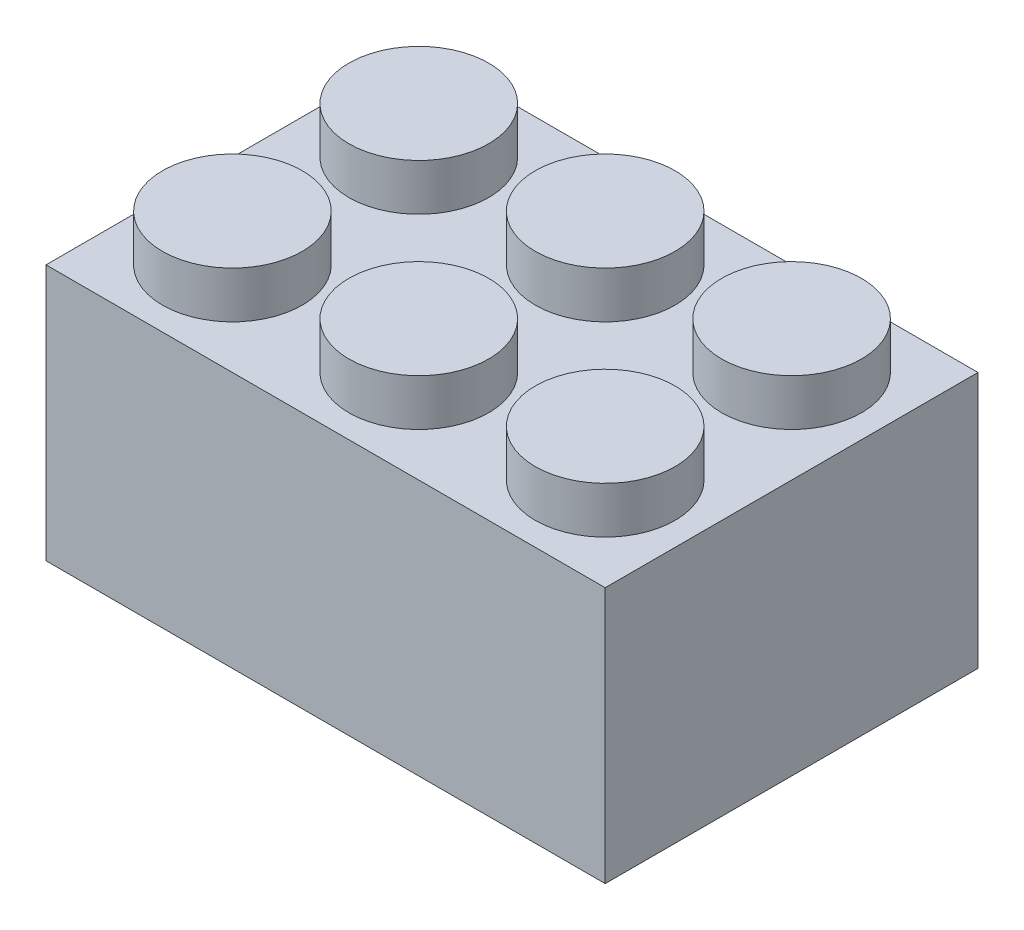
ISO-10303-21;
HEADER;
FILE_DESCRIPTION(('STEP AP214'),'2;1');
FILE_NAME('part.step','',(''),(''),'','','');
FILE_SCHEMA(('AUTOMOTIVE_DESIGN { 1 0 10303 214 1 1 1 1 }'));
ENDSEC;
DATA;
#1=APPLICATION_CONTEXT('core data for automotive mechanical design processes');
#2=APPLICATION_PROTOCOL_DEFINITION('international standard','automotive_design',2000,#1);
#3=PRODUCT_CONTEXT('',#1,'mechanical');
#4=PRODUCT('Part','Part','',(#3));
#5=PRODUCT_RELATED_PRODUCT_CATEGORY('part','',(#4));
#6=PRODUCT_DEFINITION_FORMATION('','',#4);
#7=PRODUCT_DEFINITION_CONTEXT('part definition',#1,'design');
#8=PRODUCT_DEFINITION('design','',#6,#7);
#9=PRODUCT_DEFINITION_SHAPE('','',#8);
#10=(LENGTH_UNIT() NAMED_UNIT(*) SI_UNIT(.MILLI.,.METRE.));
#11=(NAMED_UNIT(*) PLANE_ANGLE_UNIT() SI_UNIT($,.RADIAN.));
#12=(NAMED_UNIT(*) SI_UNIT($,.STERADIAN.) SOLID_ANGLE_UNIT());
#13=UNCERTAINTY_MEASURE_WITH_UNIT(LENGTH_MEASURE(1.E-05),#10,'distance_accuracy_value','');
#14=(GEOMETRIC_REPRESENTATION_CONTEXT(3) GLOBAL_UNCERTAINTY_ASSIGNED_CONTEXT((#13)) GLOBAL_UNIT_ASSIGNED_CONTEXT((#10,
#11,#12)) REPRESENTATION_CONTEXT('',''));
#15=CARTESIAN_POINT('',(0.,0.,0.));
#16=DIRECTION('',(0.,0.,1.));
#17=DIRECTION('',(1.,0.,0.));
#18=AXIS2_PLACEMENT_3D('',#15,#16,#17);
#19=CARTESIAN_POINT('',(8.,13.,4.));
#20=DIRECTION('',(0.,1.,0.));
#21=DIRECTION('',(0.,0.,1.));
#22=AXIS2_PLACEMENT_3D('',#19,#20,#21);
#23=PLANE('',#22);
#24=CARTESIAN_POINT('',(8.,13.,4.));
#25=DIRECTION('',(0.,1.,0.));
#26=DIRECTION('',(0.,0.,1.));
#27=AXIS2_PLACEMENT_3D('',#24,#25,#26);
#28=CIRCLE('',#27,3.);
#29=CARTESIAN_POINT('',(8.,13.,7.));
#30=VERTEX_POINT('',#29);
#31=EDGE_CURVE('E11',#30,#30,#28,.T.);
#32=ORIENTED_EDGE('',*,*,#31,.T.);
#33=EDGE_LOOP('',(#32));
#34=FACE_BOUND('',#33,.T.);
#35=ADVANCED_FACE('F33',(#34),#23,.T.);
#36=CARTESIAN_POINT('',(8.,13.,4.));
#37=DIRECTION('',(0.,-1.,0.));
#38=DIRECTION('',(0.,0.,-1.));
#39=AXIS2_PLACEMENT_3D('',#36,#37,#38);
#40=CYLINDRICAL_SURFACE('',#39,3.);
#41=ORIENTED_EDGE('',*,*,#31,.F.);
#42=EDGE_LOOP('',(#41));
#43=FACE_BOUND('',#42,.T.);
#44=CARTESIAN_POINT('',(8.,11.,4.));
#45=DIRECTION('',(0.,1.,0.));
#46=DIRECTION('',(0.,0.,1.));
#47=AXIS2_PLACEMENT_3D('',#44,#45,#46);
#48=CIRCLE('',#47,3.);
#49=CARTESIAN_POINT('',(8.,11.,7.));
#50=VERTEX_POINT('',#49);
#51=EDGE_CURVE('E40',#50,#50,#48,.T.);
#52=ORIENTED_EDGE('',*,*,#51,.T.);
#53=EDGE_LOOP('',(#52));
#54=FACE_BOUND('',#53,.T.);
#55=ADVANCED_FACE('F228',(#43,#54),#40,.T.);
#56=CARTESIAN_POINT('',(0.,13.,4.));
#57=DIRECTION('',(0.,1.,0.));
#58=DIRECTION('',(0.,0.,1.));
#59=AXIS2_PLACEMENT_3D('',#56,#57,#58);
#60=PLANE('',#59);
#61=CARTESIAN_POINT('',(0.,13.,4.));
#62=DIRECTION('',(0.,1.,0.));
#63=DIRECTION('',(0.,0.,1.));
#64=AXIS2_PLACEMENT_3D('',#61,#62,#63);
#65=CIRCLE('',#64,3.);
#66=CARTESIAN_POINT('',(0.,13.,7.));
#67=VERTEX_POINT('',#66);
#68=EDGE_CURVE('E223',#67,#67,#65,.T.);
#69=ORIENTED_EDGE('',*,*,#68,.T.);
#70=EDGE_LOOP('',(#69));
#71=FACE_BOUND('',#70,.T.);
#72=ADVANCED_FACE('F253',(#71),#60,.T.);
#73=CARTESIAN_POINT('',(0.,13.,4.));
#74=DIRECTION('',(0.,-1.,0.));
#75=DIRECTION('',(0.,0.,-1.));
#76=AXIS2_PLACEMENT_3D('',#73,#74,#75);
#77=CYLINDRICAL_SURFACE('',#76,3.);
#78=ORIENTED_EDGE('',*,*,#68,.F.);
#79=EDGE_LOOP('',(#78));
#80=FACE_BOUND('',#79,.T.);
#81=CARTESIAN_POINT('',(0.,11.,4.));
#82=DIRECTION('',(0.,1.,0.));
#83=DIRECTION('',(0.,0.,1.));
#84=AXIS2_PLACEMENT_3D('',#81,#82,#83);
#85=CIRCLE('',#84,3.);
#86=CARTESIAN_POINT('',(0.,11.,7.));
#87=VERTEX_POINT('',#86);
#88=EDGE_CURVE('E220',#87,#87,#85,.T.);
#89=ORIENTED_EDGE('',*,*,#88,.T.);
#90=EDGE_LOOP('',(#89));
#91=FACE_BOUND('',#90,.T.);
#92=ADVANCED_FACE('F259',(#80,#91),#77,.T.);
#93=CARTESIAN_POINT('',(-8.,13.,4.));
#94=DIRECTION('',(0.,1.,0.));
#95=DIRECTION('',(0.,0.,1.));
#96=AXIS2_PLACEMENT_3D('',#93,#94,#95);
#97=PLANE('',#96);
#98=CARTESIAN_POINT('',(-8.,13.,4.));
#99=DIRECTION('',(0.,1.,0.));
#100=DIRECTION('',(0.,0.,1.));
#101=AXIS2_PLACEMENT_3D('',#98,#99,#100);
#102=CIRCLE('',#101,3.);
#103=CARTESIAN_POINT('',(-8.,13.,7.));
#104=VERTEX_POINT('',#103);
#105=EDGE_CURVE('E217',#104,#104,#102,.T.);
#106=ORIENTED_EDGE('',*,*,#105,.T.);
#107=EDGE_LOOP('',(#106));
#108=FACE_BOUND('',#107,.T.);
#109=ADVANCED_FACE('F265',(#108),#97,.T.);
#110=CARTESIAN_POINT('',(-8.,13.,4.));
#111=DIRECTION('',(0.,-1.,0.));
#112=DIRECTION('',(0.,0.,-1.));
#113=AXIS2_PLACEMENT_3D('',#110,#111,#112);
#114=CYLINDRICAL_SURFACE('',#113,3.);
#115=ORIENTED_EDGE('',*,*,#105,.F.);
#116=EDGE_LOOP('',(#115));
#117=FACE_BOUND('',#116,.T.);
#118=CARTESIAN_POINT('',(-8.,11.,4.));
#119=DIRECTION('',(0.,1.,0.));
#120=DIRECTION('',(0.,0.,1.));
#121=AXIS2_PLACEMENT_3D('',#118,#119,#120);
#122=CIRCLE('',#121,3.);
#123=CARTESIAN_POINT('',(-8.,11.,7.));
#124=VERTEX_POINT('',#123);
#125=EDGE_CURVE('E214',#124,#124,#122,.T.);
#126=ORIENTED_EDGE('',*,*,#125,.T.);
#127=EDGE_LOOP('',(#126));
#128=FACE_BOUND('',#127,.T.);
#129=ADVANCED_FACE('F269',(#117,#128),#114,.T.);
#130=CARTESIAN_POINT('',(8.,13.,-4.));
#131=DIRECTION('',(0.,1.,0.));
#132=DIRECTION('',(0.,0.,1.));
#133=AXIS2_PLACEMENT_3D('',#130,#131,#132);
#134=PLANE('',#133);
#135=CARTESIAN_POINT('',(8.,13.,-4.));
#136=DIRECTION('',(0.,1.,0.));
#137=DIRECTION('',(0.,0.,1.));
#138=AXIS2_PLACEMENT_3D('',#135,#136,#137);
#139=CIRCLE('',#138,3.);
#140=CARTESIAN_POINT('',(8.,13.,-1.));
#141=VERTEX_POINT('',#140);
#142=EDGE_CURVE('E211',#141,#141,#139,.T.);
#143=ORIENTED_EDGE('',*,*,#142,.T.);
#144=EDGE_LOOP('',(#143));
#145=FACE_BOUND('',#144,.T.);
#146=ADVANCED_FACE('F273',(#145),#134,.T.);
#147=CARTESIAN_POINT('',(8.,13.,-4.));
#148=DIRECTION('',(0.,-1.,0.));
#149=DIRECTION('',(0.,0.,-1.));
#150=AXIS2_PLACEMENT_3D('',#147,#148,#149);
#151=CYLINDRICAL_SURFACE('',#150,3.);
#152=ORIENTED_EDGE('',*,*,#142,.F.);
#153=EDGE_LOOP('',(#152));
#154=FACE_BOUND('',#153,.T.);
#155=CARTESIAN_POINT('',(8.,11.,-4.));
#156=DIRECTION('',(0.,1.,0.));
#157=DIRECTION('',(0.,0.,1.));
#158=AXIS2_PLACEMENT_3D('',#155,#156,#157);
#159=CIRCLE('',#158,3.);
#160=CARTESIAN_POINT('',(8.,11.,-1.));
#161=VERTEX_POINT('',#160);
#162=EDGE_CURVE('E208',#161,#161,#159,.T.);
#163=ORIENTED_EDGE('',*,*,#162,.T.);
#164=EDGE_LOOP('',(#163));
#165=FACE_BOUND('',#164,.T.);
#166=ADVANCED_FACE('F277',(#154,#165),#151,.T.);
#167=CARTESIAN_POINT('',(-12.,11.,8.));
#168=DIRECTION('',(1.,0.,0.));
#169=DIRECTION('',(0.,0.,-1.));
#170=AXIS2_PLACEMENT_3D('',#167,#168,#169);
#171=PLANE('',#170);
#172=DIRECTION('',(0.,0.,1.));
#173=VECTOR('',#172,1.);
#174=CARTESIAN_POINT('',(-12.,0.,8.));
#175=LINE('',#174,#173);
#176=CARTESIAN_POINT('',(-12.,0.,-8.));
#177=VERTEX_POINT('',#176);
#178=CARTESIAN_POINT('',(-12.,0.,8.));
#179=VERTEX_POINT('',#178);
#180=EDGE_CURVE('E183',#177,#179,#175,.T.);
#181=ORIENTED_EDGE('',*,*,#180,.T.);
#182=DIRECTION('',(0.,-1.,0.));
#183=VECTOR('',#182,1.);
#184=CARTESIAN_POINT('',(-12.,11.,8.));
#185=LINE('',#184,#183);
#186=CARTESIAN_POINT('',(-12.,11.,8.));
#187=VERTEX_POINT('',#186);
#188=EDGE_CURVE('E206',#187,#179,#185,.T.);
#189=ORIENTED_EDGE('',*,*,#188,.F.);
#190=DIRECTION('',(0.,0.,1.));
#191=VECTOR('',#190,1.);
#192=CARTESIAN_POINT('',(-12.,11.,8.));
#193=LINE('',#192,#191);
#194=CARTESIAN_POINT('',(-12.,11.,-8.));
#195=VERTEX_POINT('',#194);
#196=EDGE_CURVE('E186',#195,#187,#193,.T.);
#197=ORIENTED_EDGE('',*,*,#196,.F.);
#198=DIRECTION('',(0.,-1.,0.));
#199=VECTOR('',#198,1.);
#200=CARTESIAN_POINT('',(-12.,11.,-8.));
#201=LINE('',#200,#199);
#202=EDGE_CURVE('E192',#195,#177,#201,.T.);
#203=ORIENTED_EDGE('',*,*,#202,.T.);
#204=EDGE_LOOP('',(#181,#189,#197,#203));
#205=FACE_BOUND('',#204,.T.);
#206=ADVANCED_FACE('F281',(#205),#171,.F.);
#207=CARTESIAN_POINT('',(12.,11.,8.));
#208=DIRECTION('',(0.,0.,-1.));
#209=DIRECTION('',(-1.,0.,0.));
#210=AXIS2_PLACEMENT_3D('',#207,#208,#209);
#211=PLANE('',#210);
#212=DIRECTION('',(1.,0.,0.));
#213=VECTOR('',#212,1.);
#214=CARTESIAN_POINT('',(12.,0.,8.));
#215=LINE('',#214,#213);
#216=CARTESIAN_POINT('',(12.,0.,8.));
#217=VERTEX_POINT('',#216);
#218=EDGE_CURVE('E195',#179,#217,#215,.T.);
#219=ORIENTED_EDGE('',*,*,#218,.T.);
#220=DIRECTION('',(0.,-1.,0.));
#221=VECTOR('',#220,1.);
#222=CARTESIAN_POINT('',(12.,11.,8.));
#223=LINE('',#222,#221);
#224=CARTESIAN_POINT('',(12.,11.,8.));
#225=VERTEX_POINT('',#224);
#226=EDGE_CURVE('E203',#225,#217,#223,.T.);
#227=ORIENTED_EDGE('',*,*,#226,.F.);
#228=DIRECTION('',(1.,0.,0.));
#229=VECTOR('',#228,1.);
#230=CARTESIAN_POINT('',(12.,11.,8.));
#231=LINE('',#230,#229);
#232=EDGE_CURVE('E85',#187,#225,#231,.T.);
#233=ORIENTED_EDGE('',*,*,#232,.F.);
#234=ORIENTED_EDGE('',*,*,#188,.T.);
#235=EDGE_LOOP('',(#219,#227,#233,#234));
#236=FACE_BOUND('',#235,.T.);
#237=ADVANCED_FACE('F285',(#236),#211,.F.);
#238=CARTESIAN_POINT('',(12.,11.,8.));
#239=DIRECTION('',(-1.,0.,0.));
#240=DIRECTION('',(0.,0.,1.));
#241=AXIS2_PLACEMENT_3D('',#238,#239,#240);
#242=PLANE('',#241);
#243=DIRECTION('',(0.,0.,-1.));
#244=VECTOR('',#243,1.);
#245=CARTESIAN_POINT('',(12.,0.,8.));
#246=LINE('',#245,#244);
#247=CARTESIAN_POINT('',(12.,0.,-8.));
#248=VERTEX_POINT('',#247);
#249=EDGE_CURVE('E197',#217,#248,#246,.T.);
#250=ORIENTED_EDGE('',*,*,#249,.T.);
#251=DIRECTION('',(0.,-1.,0.));
#252=VECTOR('',#251,1.);
#253=CARTESIAN_POINT('',(12.,11.,-8.));
#254=LINE('',#253,#252);
#255=CARTESIAN_POINT('',(12.,11.,-8.));
#256=VERTEX_POINT('',#255);
#257=EDGE_CURVE('E201',#256,#248,#254,.T.);
#258=ORIENTED_EDGE('',*,*,#257,.F.);
#259=DIRECTION('',(0.,0.,-1.));
#260=VECTOR('',#259,1.);
#261=CARTESIAN_POINT('',(12.,11.,8.));
#262=LINE('',#261,#260);
#263=EDGE_CURVE('E189',#225,#256,#262,.T.);
#264=ORIENTED_EDGE('',*,*,#263,.F.);
#265=ORIENTED_EDGE('',*,*,#226,.T.);
#266=EDGE_LOOP('',(#250,#258,#264,#265));
#267=FACE_BOUND('',#266,.T.);
#268=ADVANCED_FACE('F243',(#267),#242,.F.);
#269=CARTESIAN_POINT('',(12.,11.,-8.));
#270=DIRECTION('',(0.,0.,1.));
#271=DIRECTION('',(1.,0.,0.));
#272=AXIS2_PLACEMENT_3D('',#269,#270,#271);
#273=PLANE('',#272);
#274=DIRECTION('',(-1.,0.,0.));
#275=VECTOR('',#274,1.);
#276=CARTESIAN_POINT('',(12.,0.,-8.));
#277=LINE('',#276,#275);
#278=EDGE_CURVE('E77',#248,#177,#277,.T.);
#279=ORIENTED_EDGE('',*,*,#278,.T.);
#280=ORIENTED_EDGE('',*,*,#202,.F.);
#281=DIRECTION('',(-1.,0.,0.));
#282=VECTOR('',#281,1.);
#283=CARTESIAN_POINT('',(12.,11.,-8.));
#284=LINE('',#283,#282);
#285=EDGE_CURVE('E56',#256,#195,#284,.T.);
#286=ORIENTED_EDGE('',*,*,#285,.F.);
#287=ORIENTED_EDGE('',*,*,#257,.T.);
#288=EDGE_LOOP('',(#279,#280,#286,#287));
#289=FACE_BOUND('',#288,.T.);
#290=ADVANCED_FACE('F233',(#289),#273,.F.);
#291=CARTESIAN_POINT('',(0.,11.,0.));
#292=DIRECTION('',(0.,1.,0.));
#293=DIRECTION('',(0.,0.,1.));
#294=AXIS2_PLACEMENT_3D('',#291,#292,#293);
#295=PLANE('',#294);
#296=CARTESIAN_POINT('',(0.,11.,-4.));
#297=DIRECTION('',(0.,1.,0.));
#298=DIRECTION('',(0.,0.,1.));
#299=AXIS2_PLACEMENT_3D('',#296,#297,#298);
#300=CIRCLE('',#299,3.);
#301=CARTESIAN_POINT('',(0.,11.,-1.));
#302=VERTEX_POINT('',#301);
#303=EDGE_CURVE('E172',#302,#302,#300,.T.);
#304=ORIENTED_EDGE('',*,*,#303,.F.);
#305=EDGE_LOOP('',(#304));
#306=FACE_BOUND('',#305,.T.);
#307=CARTESIAN_POINT('',(-8.,11.,-4.));
#308=DIRECTION('',(0.,1.,0.));
#309=DIRECTION('',(0.,0.,1.));
#310=AXIS2_PLACEMENT_3D('',#307,#308,#309);
#311=CIRCLE('',#310,3.);
#312=CARTESIAN_POINT('',(-8.,11.,-1.));
#313=VERTEX_POINT('',#312);
#314=EDGE_CURVE('E179',#313,#313,#311,.T.);
#315=ORIENTED_EDGE('',*,*,#314,.F.);
#316=EDGE_LOOP('',(#315));
#317=FACE_BOUND('',#316,.T.);
#318=ORIENTED_EDGE('',*,*,#196,.T.);
#319=ORIENTED_EDGE('',*,*,#232,.T.);
#320=ORIENTED_EDGE('',*,*,#263,.T.);
#321=ORIENTED_EDGE('',*,*,#285,.T.);
#322=EDGE_LOOP('',(#318,#319,#320,#321));
#323=FACE_BOUND('',#322,.T.);
#324=ORIENTED_EDGE('',*,*,#162,.F.);
#325=EDGE_LOOP('',(#324));
#326=FACE_BOUND('',#325,.T.);
#327=ORIENTED_EDGE('',*,*,#125,.F.);
#328=EDGE_LOOP('',(#327));
#329=FACE_BOUND('',#328,.T.);
#330=ORIENTED_EDGE('',*,*,#88,.F.);
#331=EDGE_LOOP('',(#330));
#332=FACE_BOUND('',#331,.T.);
#333=ORIENTED_EDGE('',*,*,#51,.F.);
#334=EDGE_LOOP('',(#333));
#335=FACE_BOUND('',#334,.T.);
#336=ADVANCED_FACE('F230',(#306,#317,#323,#326,#329,#332,#335),#295,.T.);
#337=CARTESIAN_POINT('',(0.,0.,0.));
#338=DIRECTION('',(0.,1.,0.));
#339=DIRECTION('',(0.,0.,1.));
#340=AXIS2_PLACEMENT_3D('',#337,#338,#339);
#341=PLANE('',#340);
#342=DIRECTION('',(-1.,0.,0.));
#343=VECTOR('',#342,1.);
#344=CARTESIAN_POINT('',(12.,0.,-7.));
#345=LINE('',#344,#343);
#346=CARTESIAN_POINT('',(11.,0.,-7.));
#347=VERTEX_POINT('',#346);
#348=CARTESIAN_POINT('',(-11.,0.,-7.));
#349=VERTEX_POINT('',#348);
#350=EDGE_CURVE('E167',#347,#349,#345,.T.);
#351=ORIENTED_EDGE('',*,*,#350,.T.);
#352=DIRECTION('',(0.,0.,1.));
#353=VECTOR('',#352,1.);
#354=CARTESIAN_POINT('',(-11.,0.,8.));
#355=LINE('',#354,#353);
#356=CARTESIAN_POINT('',(-11.,0.,7.));
#357=VERTEX_POINT('',#356);
#358=EDGE_CURVE('E158',#349,#357,#355,.T.);
#359=ORIENTED_EDGE('',*,*,#358,.T.);
#360=DIRECTION('',(1.,0.,0.));
#361=VECTOR('',#360,1.);
#362=CARTESIAN_POINT('',(12.,0.,7.));
#363=LINE('',#362,#361);
#364=CARTESIAN_POINT('',(11.,0.,7.));
#365=VERTEX_POINT('',#364);
#366=EDGE_CURVE('E166',#357,#365,#363,.T.);
#367=ORIENTED_EDGE('',*,*,#366,.T.);
#368=DIRECTION('',(0.,0.,-1.));
#369=VECTOR('',#368,1.);
#370=CARTESIAN_POINT('',(11.,0.,8.));
#371=LINE('',#370,#369);
#372=EDGE_CURVE('E47',#365,#347,#371,.T.);
#373=ORIENTED_EDGE('',*,*,#372,.T.);
#374=EDGE_LOOP('',(#351,#359,#367,#373));
#375=FACE_BOUND('',#374,.T.);
#376=ORIENTED_EDGE('',*,*,#180,.F.);
#377=ORIENTED_EDGE('',*,*,#278,.F.);
#378=ORIENTED_EDGE('',*,*,#249,.F.);
#379=ORIENTED_EDGE('',*,*,#218,.F.);
#380=EDGE_LOOP('',(#376,#377,#378,#379));
#381=FACE_BOUND('',#380,.T.);
#382=ADVANCED_FACE('F232',(#375,#381),#341,.F.);
#383=CARTESIAN_POINT('',(-8.,13.,-4.));
#384=DIRECTION('',(0.,-1.,0.));
#385=DIRECTION('',(0.,0.,-1.));
#386=AXIS2_PLACEMENT_3D('',#383,#384,#385);
#387=CYLINDRICAL_SURFACE('',#386,3.);
#388=CARTESIAN_POINT('',(-8.,13.,-4.));
#389=DIRECTION('',(0.,1.,0.));
#390=DIRECTION('',(0.,0.,1.));
#391=AXIS2_PLACEMENT_3D('',#388,#389,#390);
#392=CIRCLE('',#391,3.);
#393=CARTESIAN_POINT('',(-8.,13.,-1.));
#394=VERTEX_POINT('',#393);
#395=EDGE_CURVE('E180',#394,#394,#392,.T.);
#396=ORIENTED_EDGE('',*,*,#395,.F.);
#397=EDGE_LOOP('',(#396));
#398=FACE_BOUND('',#397,.T.);
#399=ORIENTED_EDGE('',*,*,#314,.T.);
#400=EDGE_LOOP('',(#399));
#401=FACE_BOUND('',#400,.T.);
#402=ADVANCED_FACE('F240',(#398,#401),#387,.T.);
#403=CARTESIAN_POINT('',(-8.,13.,-4.));
#404=DIRECTION('',(0.,1.,0.));
#405=DIRECTION('',(0.,0.,1.));
#406=AXIS2_PLACEMENT_3D('',#403,#404,#405);
#407=PLANE('',#406);
#408=ORIENTED_EDGE('',*,*,#395,.T.);
#409=EDGE_LOOP('',(#408));
#410=FACE_BOUND('',#409,.T.);
#411=ADVANCED_FACE('F325',(#410),#407,.T.);
#412=CARTESIAN_POINT('',(0.,13.,-4.));
#413=DIRECTION('',(0.,-1.,0.));
#414=DIRECTION('',(0.,0.,-1.));
#415=AXIS2_PLACEMENT_3D('',#412,#413,#414);
#416=CYLINDRICAL_SURFACE('',#415,3.);
#417=CARTESIAN_POINT('',(0.,13.,-4.));
#418=DIRECTION('',(0.,1.,0.));
#419=DIRECTION('',(0.,0.,1.));
#420=AXIS2_PLACEMENT_3D('',#417,#418,#419);
#421=CIRCLE('',#420,3.);
#422=CARTESIAN_POINT('',(0.,13.,-1.));
#423=VERTEX_POINT('',#422);
#424=EDGE_CURVE('E175',#423,#423,#421,.T.);
#425=ORIENTED_EDGE('',*,*,#424,.F.);
#426=EDGE_LOOP('',(#425));
#427=FACE_BOUND('',#426,.T.);
#428=ORIENTED_EDGE('',*,*,#303,.T.);
#429=EDGE_LOOP('',(#428));
#430=FACE_BOUND('',#429,.T.);
#431=ADVANCED_FACE('F334',(#427,#430),#416,.T.);
#432=CARTESIAN_POINT('',(0.,13.,-4.));
#433=DIRECTION('',(0.,1.,0.));
#434=DIRECTION('',(0.,0.,1.));
#435=AXIS2_PLACEMENT_3D('',#432,#433,#434);
#436=PLANE('',#435);
#437=ORIENTED_EDGE('',*,*,#424,.T.);
#438=EDGE_LOOP('',(#437));
#439=FACE_BOUND('',#438,.T.);
#440=ADVANCED_FACE('F392',(#439),#436,.T.);
#441=CARTESIAN_POINT('',(8.,12.,4.));
#442=DIRECTION('',(0.,1.,0.));
#443=DIRECTION('',(0.,0.,1.));
#444=AXIS2_PLACEMENT_3D('',#441,#442,#443);
#445=PLANE('',#444);
#446=CARTESIAN_POINT('',(8.,12.,4.));
#447=DIRECTION('',(0.,1.,0.));
#448=DIRECTION('',(0.,0.,1.));
#449=AXIS2_PLACEMENT_3D('',#446,#447,#448);
#450=CIRCLE('',#449,2.);
#451=CARTESIAN_POINT('',(8.,12.,6.));
#452=VERTEX_POINT('',#451);
#453=EDGE_CURVE('E176',#452,#452,#450,.T.);
#454=ORIENTED_EDGE('',*,*,#453,.F.);
#455=EDGE_LOOP('',(#454));
#456=FACE_BOUND('',#455,.T.);
#457=ADVANCED_FACE('F402',(#456),#445,.F.);
#458=CARTESIAN_POINT('',(8.,13.,4.));
#459=DIRECTION('',(0.,-1.,0.));
#460=DIRECTION('',(0.,0.,-1.));
#461=AXIS2_PLACEMENT_3D('',#458,#459,#460);
#462=CYLINDRICAL_SURFACE('',#461,2.);
#463=ORIENTED_EDGE('',*,*,#453,.T.);
#464=EDGE_LOOP('',(#463));
#465=FACE_BOUND('',#464,.T.);
#466=CARTESIAN_POINT('',(8.,10.,4.));
#467=DIRECTION('',(0.,1.,0.));
#468=DIRECTION('',(0.,0.,1.));
#469=AXIS2_PLACEMENT_3D('',#466,#467,#468);
#470=CIRCLE('',#469,2.);
#471=CARTESIAN_POINT('',(8.,10.,6.));
#472=VERTEX_POINT('',#471);
#473=EDGE_CURVE('E147',#472,#472,#470,.T.);
#474=ORIENTED_EDGE('',*,*,#473,.F.);
#475=EDGE_LOOP('',(#474));
#476=FACE_BOUND('',#475,.T.);
#477=ADVANCED_FACE('F417',(#465,#476),#462,.F.);
#478=CARTESIAN_POINT('',(0.,12.,4.));
#479=DIRECTION('',(0.,1.,0.));
#480=DIRECTION('',(0.,0.,1.));
#481=AXIS2_PLACEMENT_3D('',#478,#479,#480);
#482=PLANE('',#481);
#483=CARTESIAN_POINT('',(0.,12.,4.));
#484=DIRECTION('',(0.,1.,0.));
#485=DIRECTION('',(0.,0.,1.));
#486=AXIS2_PLACEMENT_3D('',#483,#484,#485);
#487=CIRCLE('',#486,2.);
#488=CARTESIAN_POINT('',(0.,12.,6.));
#489=VERTEX_POINT('',#488);
#490=EDGE_CURVE('E144',#489,#489,#487,.T.);
#491=ORIENTED_EDGE('',*,*,#490,.F.);
#492=EDGE_LOOP('',(#491));
#493=FACE_BOUND('',#492,.T.);
#494=ADVANCED_FACE('F427',(#493),#482,.F.);
#495=CARTESIAN_POINT('',(0.,13.,4.));
#496=DIRECTION('',(0.,-1.,0.));
#497=DIRECTION('',(0.,0.,-1.));
#498=AXIS2_PLACEMENT_3D('',#495,#496,#497);
#499=CYLINDRICAL_SURFACE('',#498,2.);
#500=ORIENTED_EDGE('',*,*,#490,.T.);
#501=EDGE_LOOP('',(#500));
#502=FACE_BOUND('',#501,.T.);
#503=CARTESIAN_POINT('',(0.,10.,4.));
#504=DIRECTION('',(0.,1.,0.));
#505=DIRECTION('',(0.,0.,1.));
#506=AXIS2_PLACEMENT_3D('',#503,#504,#505);
#507=CIRCLE('',#506,2.);
#508=CARTESIAN_POINT('',(0.,10.,6.));
#509=VERTEX_POINT('',#508);
#510=EDGE_CURVE('E141',#509,#509,#507,.T.);
#511=ORIENTED_EDGE('',*,*,#510,.F.);
#512=EDGE_LOOP('',(#511));
#513=FACE_BOUND('',#512,.T.);
#514=ADVANCED_FACE('F437',(#502,#513),#499,.F.);
#515=CARTESIAN_POINT('',(-8.,12.,4.));
#516=DIRECTION('',(0.,1.,0.));
#517=DIRECTION('',(0.,0.,1.));
#518=AXIS2_PLACEMENT_3D('',#515,#516,#517);
#519=PLANE('',#518);
#520=CARTESIAN_POINT('',(-8.,12.,4.));
#521=DIRECTION('',(0.,1.,0.));
#522=DIRECTION('',(0.,0.,1.));
#523=AXIS2_PLACEMENT_3D('',#520,#521,#522);
#524=CIRCLE('',#523,2.);
#525=CARTESIAN_POINT('',(-8.,12.,6.));
#526=VERTEX_POINT('',#525);
#527=EDGE_CURVE('E140',#526,#526,#524,.T.);
#528=ORIENTED_EDGE('',*,*,#527,.F.);
#529=EDGE_LOOP('',(#528));
#530=FACE_BOUND('',#529,.T.);
#531=ADVANCED_FACE('F447',(#530),#519,.F.);
#532=CARTESIAN_POINT('',(-8.,13.,4.));
#533=DIRECTION('',(0.,-1.,0.));
#534=DIRECTION('',(0.,0.,-1.));
#535=AXIS2_PLACEMENT_3D('',#532,#533,#534);
#536=CYLINDRICAL_SURFACE('',#535,2.);
#537=ORIENTED_EDGE('',*,*,#527,.T.);
#538=EDGE_LOOP('',(#537));
#539=FACE_BOUND('',#538,.T.);
#540=CARTESIAN_POINT('',(-8.,10.,4.));
#541=DIRECTION('',(0.,1.,0.));
#542=DIRECTION('',(0.,0.,1.));
#543=AXIS2_PLACEMENT_3D('',#540,#541,#542);
#544=CIRCLE('',#543,2.);
#545=CARTESIAN_POINT('',(-8.,10.,6.));
#546=VERTEX_POINT('',#545);
#547=EDGE_CURVE('E137',#546,#546,#544,.T.);
#548=ORIENTED_EDGE('',*,*,#547,.F.);
#549=EDGE_LOOP('',(#548));
#550=FACE_BOUND('',#549,.T.);
#551=ADVANCED_FACE('F457',(#539,#550),#536,.F.);
#552=CARTESIAN_POINT('',(8.,12.,-4.));
#553=DIRECTION('',(0.,1.,0.));
#554=DIRECTION('',(0.,0.,1.));
#555=AXIS2_PLACEMENT_3D('',#552,#553,#554);
#556=PLANE('',#555);
#557=CARTESIAN_POINT('',(8.,12.,-4.));
#558=DIRECTION('',(0.,1.,0.));
#559=DIRECTION('',(0.,0.,1.));
#560=AXIS2_PLACEMENT_3D('',#557,#558,#559);
#561=CIRCLE('',#560,2.);
#562=CARTESIAN_POINT('',(8.,12.,-2.));
#563=VERTEX_POINT('',#562);
#564=EDGE_CURVE('E136',#563,#563,#561,.T.);
#565=ORIENTED_EDGE('',*,*,#564,.F.);
#566=EDGE_LOOP('',(#565));
#567=FACE_BOUND('',#566,.T.);
#568=ADVANCED_FACE('F467',(#567),#556,.F.);
#569=CARTESIAN_POINT('',(8.,13.,-4.));
#570=DIRECTION('',(0.,-1.,0.));
#571=DIRECTION('',(0.,0.,-1.));
#572=AXIS2_PLACEMENT_3D('',#569,#570,#571);
#573=CYLINDRICAL_SURFACE('',#572,2.);
#574=ORIENTED_EDGE('',*,*,#564,.T.);
#575=EDGE_LOOP('',(#574));
#576=FACE_BOUND('',#575,.T.);
#577=CARTESIAN_POINT('',(8.,10.,-4.));
#578=DIRECTION('',(0.,1.,0.));
#579=DIRECTION('',(0.,0.,1.));
#580=AXIS2_PLACEMENT_3D('',#577,#578,#579);
#581=CIRCLE('',#580,2.);
#582=CARTESIAN_POINT('',(8.,10.,-2.));
#583=VERTEX_POINT('',#582);
#584=EDGE_CURVE('E133',#583,#583,#581,.T.);
#585=ORIENTED_EDGE('',*,*,#584,.F.);
#586=EDGE_LOOP('',(#585));
#587=FACE_BOUND('',#586,.T.);
#588=ADVANCED_FACE('F477',(#576,#587),#573,.F.);
#589=CARTESIAN_POINT('',(-11.,11.,8.));
#590=DIRECTION('',(1.,0.,0.));
#591=DIRECTION('',(0.,0.,-1.));
#592=AXIS2_PLACEMENT_3D('',#589,#590,#591);
#593=PLANE('',#592);
#594=ORIENTED_EDGE('',*,*,#358,.F.);
#595=DIRECTION('',(0.,-1.,0.));
#596=VECTOR('',#595,1.);
#597=CARTESIAN_POINT('',(-11.,11.,-7.));
#598=LINE('',#597,#596);
#599=CARTESIAN_POINT('',(-11.,10.,-7.));
#600=VERTEX_POINT('',#599);
#601=EDGE_CURVE('E129',#600,#349,#598,.T.);
#602=ORIENTED_EDGE('',*,*,#601,.F.);
#603=DIRECTION('',(0.,0.,1.));
#604=VECTOR('',#603,1.);
#605=CARTESIAN_POINT('',(-11.,10.,8.));
#606=LINE('',#605,#604);
#607=CARTESIAN_POINT('',(-11.,10.,7.));
#608=VERTEX_POINT('',#607);
#609=EDGE_CURVE('E118',#600,#608,#606,.T.);
#610=ORIENTED_EDGE('',*,*,#609,.T.);
#611=DIRECTION('',(0.,-1.,0.));
#612=VECTOR('',#611,1.);
#613=CARTESIAN_POINT('',(-11.,11.,7.));
#614=LINE('',#613,#612);
#615=EDGE_CURVE('E112',#608,#357,#614,.T.);
#616=ORIENTED_EDGE('',*,*,#615,.T.);
#617=EDGE_LOOP('',(#594,#602,#610,#616));
#618=FACE_BOUND('',#617,.T.);
#619=ADVANCED_FACE('F487',(#618),#593,.T.);
#620=CARTESIAN_POINT('',(12.,11.,7.));
#621=DIRECTION('',(0.,0.,-1.));
#622=DIRECTION('',(-1.,0.,0.));
#623=AXIS2_PLACEMENT_3D('',#620,#621,#622);
#624=PLANE('',#623);
#625=ORIENTED_EDGE('',*,*,#366,.F.);
#626=ORIENTED_EDGE('',*,*,#615,.F.);
#627=DIRECTION('',(1.,0.,0.));
#628=VECTOR('',#627,1.);
#629=CARTESIAN_POINT('',(12.,10.,7.));
#630=LINE('',#629,#628);
#631=CARTESIAN_POINT('',(11.,10.,7.));
#632=VERTEX_POINT('',#631);
#633=EDGE_CURVE('E107',#608,#632,#630,.T.);
#634=ORIENTED_EDGE('',*,*,#633,.T.);
#635=DIRECTION('',(0.,-1.,0.));
#636=VECTOR('',#635,1.);
#637=CARTESIAN_POINT('',(11.,11.,7.));
#638=LINE('',#637,#636);
#639=EDGE_CURVE('E109',#632,#365,#638,.T.);
#640=ORIENTED_EDGE('',*,*,#639,.T.);
#641=EDGE_LOOP('',(#625,#626,#634,#640));
#642=FACE_BOUND('',#641,.T.);
#643=ADVANCED_FACE('F108',(#642),#624,.T.);
#644=CARTESIAN_POINT('',(11.,11.,8.));
#645=DIRECTION('',(-1.,0.,0.));
#646=DIRECTION('',(0.,0.,1.));
#647=AXIS2_PLACEMENT_3D('',#644,#645,#646);
#648=PLANE('',#647);
#649=ORIENTED_EDGE('',*,*,#372,.F.);
#650=ORIENTED_EDGE('',*,*,#639,.F.);
#651=DIRECTION('',(0.,0.,-1.));
#652=VECTOR('',#651,1.);
#653=CARTESIAN_POINT('',(11.,10.,8.));
#654=LINE('',#653,#652);
#655=CARTESIAN_POINT('',(11.,10.,-7.));
#656=VERTEX_POINT('',#655);
#657=EDGE_CURVE('E117',#632,#656,#654,.T.);
#658=ORIENTED_EDGE('',*,*,#657,.T.);
#659=DIRECTION('',(0.,-1.,0.));
#660=VECTOR('',#659,1.);
#661=CARTESIAN_POINT('',(11.,11.,-7.));
#662=LINE('',#661,#660);
#663=EDGE_CURVE('E122',#656,#347,#662,.T.);
#664=ORIENTED_EDGE('',*,*,#663,.T.);
#665=EDGE_LOOP('',(#649,#650,#658,#664));
#666=FACE_BOUND('',#665,.T.);
#667=ADVANCED_FACE('F120',(#666),#648,.T.);
#668=CARTESIAN_POINT('',(12.,11.,-7.));
#669=DIRECTION('',(0.,0.,1.));
#670=DIRECTION('',(1.,0.,0.));
#671=AXIS2_PLACEMENT_3D('',#668,#669,#670);
#672=PLANE('',#671);
#673=ORIENTED_EDGE('',*,*,#350,.F.);
#674=ORIENTED_EDGE('',*,*,#663,.F.);
#675=DIRECTION('',(-1.,0.,0.));
#676=VECTOR('',#675,1.);
#677=CARTESIAN_POINT('',(12.,10.,-7.));
#678=LINE('',#677,#676);
#679=EDGE_CURVE('E127',#656,#600,#678,.T.);
#680=ORIENTED_EDGE('',*,*,#679,.T.);
#681=ORIENTED_EDGE('',*,*,#601,.T.);
#682=EDGE_LOOP('',(#673,#674,#680,#681));
#683=FACE_BOUND('',#682,.T.);
#684=ADVANCED_FACE('F514',(#683),#672,.T.);
#685=CARTESIAN_POINT('',(0.,10.,0.));
#686=DIRECTION('',(0.,1.,0.));
#687=DIRECTION('',(0.,0.,1.));
#688=AXIS2_PLACEMENT_3D('',#685,#686,#687);
#689=PLANE('',#688);
#690=CARTESIAN_POINT('',(0.,10.,-4.));
#691=DIRECTION('',(0.,1.,0.));
#692=DIRECTION('',(0.,0.,1.));
#693=AXIS2_PLACEMENT_3D('',#690,#691,#692);
#694=CIRCLE('',#693,2.);
#695=CARTESIAN_POINT('',(0.,10.,-2.));
#696=VERTEX_POINT('',#695);
#697=EDGE_CURVE('E163',#696,#696,#694,.T.);
#698=ORIENTED_EDGE('',*,*,#697,.T.);
#699=EDGE_LOOP('',(#698));
#700=FACE_BOUND('',#699,.T.);
#701=CARTESIAN_POINT('',(-8.,10.,-4.));
#702=DIRECTION('',(0.,1.,0.));
#703=DIRECTION('',(0.,0.,1.));
#704=AXIS2_PLACEMENT_3D('',#701,#702,#703);
#705=CIRCLE('',#704,2.);
#706=CARTESIAN_POINT('',(-8.,10.,-2.));
#707=VERTEX_POINT('',#706);
#708=EDGE_CURVE('E159',#707,#707,#705,.T.);
#709=ORIENTED_EDGE('',*,*,#708,.T.);
#710=EDGE_LOOP('',(#709));
#711=FACE_BOUND('',#710,.T.);
#712=ORIENTED_EDGE('',*,*,#609,.F.);
#713=ORIENTED_EDGE('',*,*,#679,.F.);
#714=ORIENTED_EDGE('',*,*,#657,.F.);
#715=ORIENTED_EDGE('',*,*,#633,.F.);
#716=EDGE_LOOP('',(#712,#713,#714,#715));
#717=FACE_BOUND('',#716,.T.);
#718=ORIENTED_EDGE('',*,*,#584,.T.);
#719=EDGE_LOOP('',(#718));
#720=FACE_BOUND('',#719,.T.);
#721=ORIENTED_EDGE('',*,*,#547,.T.);
#722=EDGE_LOOP('',(#721));
#723=FACE_BOUND('',#722,.T.);
#724=ORIENTED_EDGE('',*,*,#510,.T.);
#725=EDGE_LOOP('',(#724));
#726=FACE_BOUND('',#725,.T.);
#727=ORIENTED_EDGE('',*,*,#473,.T.);
#728=EDGE_LOOP('',(#727));
#729=FACE_BOUND('',#728,.T.);
#730=ADVANCED_FACE('F125',(#700,#711,#717,#720,#723,#726,#729),#689,.F.);
#731=CARTESIAN_POINT('',(-8.,13.,-4.));
#732=DIRECTION('',(0.,-1.,0.));
#733=DIRECTION('',(0.,0.,-1.));
#734=AXIS2_PLACEMENT_3D('',#731,#732,#733);
#735=CYLINDRICAL_SURFACE('',#734,2.);
#736=CARTESIAN_POINT('',(-8.,12.,-4.));
#737=DIRECTION('',(0.,1.,0.));
#738=DIRECTION('',(0.,0.,1.));
#739=AXIS2_PLACEMENT_3D('',#736,#737,#738);
#740=CIRCLE('',#739,2.);
#741=CARTESIAN_POINT('',(-8.,12.,-2.));
#742=VERTEX_POINT('',#741);
#743=EDGE_CURVE('E155',#742,#742,#740,.T.);
#744=ORIENTED_EDGE('',*,*,#743,.T.);
#745=EDGE_LOOP('',(#744));
#746=FACE_BOUND('',#745,.T.);
#747=ORIENTED_EDGE('',*,*,#708,.F.);
#748=EDGE_LOOP('',(#747));
#749=FACE_BOUND('',#748,.T.);
#750=ADVANCED_FACE('F532',(#746,#749),#735,.F.);
#751=CARTESIAN_POINT('',(-8.,12.,-4.));
#752=DIRECTION('',(0.,1.,0.));
#753=DIRECTION('',(0.,0.,1.));
#754=AXIS2_PLACEMENT_3D('',#751,#752,#753);
#755=PLANE('',#754);
#756=ORIENTED_EDGE('',*,*,#743,.F.);
#757=EDGE_LOOP('',(#756));
#758=FACE_BOUND('',#757,.T.);
#759=ADVANCED_FACE('F542',(#758),#755,.F.);
#760=CARTESIAN_POINT('',(0.,13.,-4.));
#761=DIRECTION('',(0.,-1.,0.));
#762=DIRECTION('',(0.,0.,-1.));
#763=AXIS2_PLACEMENT_3D('',#760,#761,#762);
#764=CYLINDRICAL_SURFACE('',#763,2.);
#765=CARTESIAN_POINT('',(0.,12.,-4.));
#766=DIRECTION('',(0.,1.,0.));
#767=DIRECTION('',(0.,0.,1.));
#768=AXIS2_PLACEMENT_3D('',#765,#766,#767);
#769=CIRCLE('',#768,2.);
#770=CARTESIAN_POINT('',(0.,12.,-2.));
#771=VERTEX_POINT('',#770);
#772=EDGE_CURVE('E160',#771,#771,#769,.T.);
#773=ORIENTED_EDGE('',*,*,#772,.T.);
#774=EDGE_LOOP('',(#773));
#775=FACE_BOUND('',#774,.T.);
#776=ORIENTED_EDGE('',*,*,#697,.F.);
#777=EDGE_LOOP('',(#776));
#778=FACE_BOUND('',#777,.T.);
#779=ADVANCED_FACE('F552',(#775,#778),#764,.F.);
#780=CARTESIAN_POINT('',(0.,12.,-4.));
#781=DIRECTION('',(0.,1.,0.));
#782=DIRECTION('',(0.,0.,1.));
#783=AXIS2_PLACEMENT_3D('',#780,#781,#782);
#784=PLANE('',#783);
#785=ORIENTED_EDGE('',*,*,#772,.F.);
#786=EDGE_LOOP('',(#785));
#787=FACE_BOUND('',#786,.T.);
#788=ADVANCED_FACE('F562',(#787),#784,.F.);
#789=CLOSED_SHELL('',(#35,#55,#72,#92,#109,#129,#146,#166,#206,#237,#268,#290,#336,#382,#402,
#411,#431,#440,#457,#477,#494,#514,#531,#551,#568,#588,#619,#643,#667,#684,#730,#750,#759,#779,#788));
#790=MANIFOLD_SOLID_BREP('B2',#789);
#791=ADVANCED_BREP_SHAPE_REPRESENTATION('',(#18,#790),#14);
#792=SHAPE_DEFINITION_REPRESENTATION(#9,#791);
ENDSEC;
END-ISO-10303-21;
